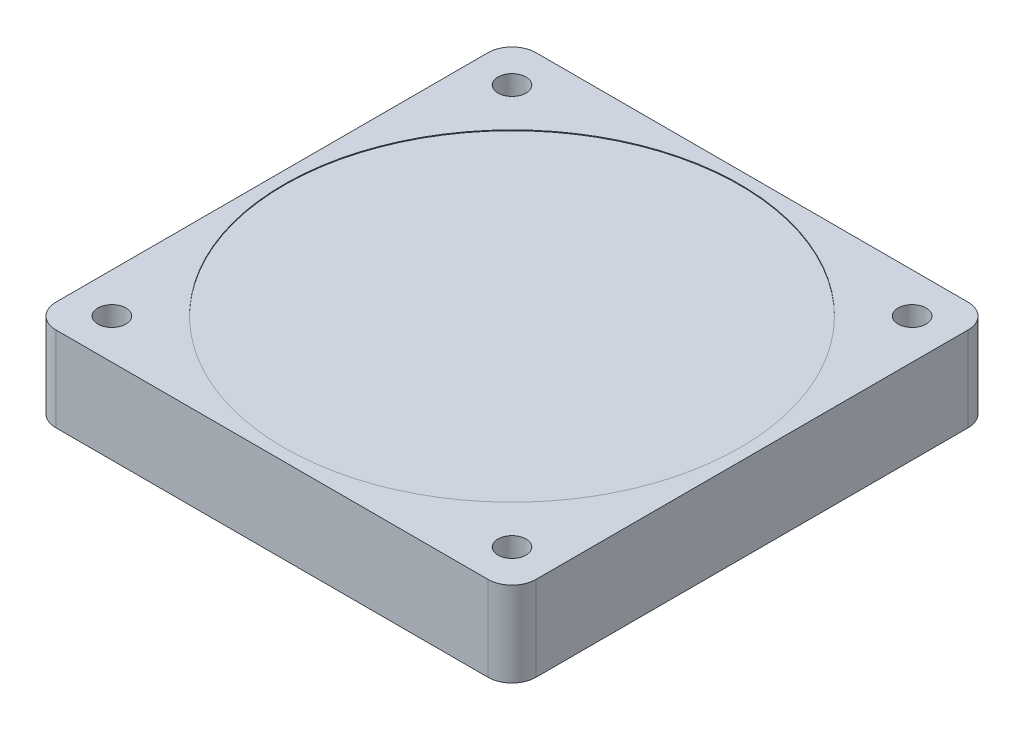
ISO-10303-21;
HEADER;
FILE_DESCRIPTION(('STEP AP214'),'2;1');
FILE_NAME('part.step','',(''),(''),'','','');
FILE_SCHEMA(('AUTOMOTIVE_DESIGN { 1 0 10303 214 1 1 1 1 }'));
ENDSEC;
DATA;
#1=APPLICATION_CONTEXT('core data for automotive mechanical design processes');
#2=APPLICATION_PROTOCOL_DEFINITION('international standard','automotive_design',2000,#1);
#3=PRODUCT_CONTEXT('',#1,'mechanical');
#4=PRODUCT('Part','Part','',(#3));
#5=PRODUCT_RELATED_PRODUCT_CATEGORY('part','',(#4));
#6=PRODUCT_DEFINITION_FORMATION('','',#4);
#7=PRODUCT_DEFINITION_CONTEXT('part definition',#1,'design');
#8=PRODUCT_DEFINITION('design','',#6,#7);
#9=PRODUCT_DEFINITION_SHAPE('','',#8);
#10=(LENGTH_UNIT() NAMED_UNIT(*) SI_UNIT(.MILLI.,.METRE.));
#11=(NAMED_UNIT(*) PLANE_ANGLE_UNIT() SI_UNIT($,.RADIAN.));
#12=(NAMED_UNIT(*) SI_UNIT($,.STERADIAN.) SOLID_ANGLE_UNIT());
#13=UNCERTAINTY_MEASURE_WITH_UNIT(LENGTH_MEASURE(1.E-05),#10,'distance_accuracy_value','');
#14=(GEOMETRIC_REPRESENTATION_CONTEXT(3) GLOBAL_UNCERTAINTY_ASSIGNED_CONTEXT((#13)) GLOBAL_UNIT_ASSIGNED_CONTEXT((#10,
#11,#12)) REPRESENTATION_CONTEXT('',''));
#15=CARTESIAN_POINT('',(0.,0.,0.));
#16=DIRECTION('',(0.,0.,1.));
#17=DIRECTION('',(1.,0.,0.));
#18=AXIS2_PLACEMENT_3D('',#15,#16,#17);
#19=CARTESIAN_POINT('',(-23.8888888888889,10.6,-31.5740740740741));
#20=DIRECTION('',(1.,0.,0.));
#21=DIRECTION('',(0.,0.,-1.));
#22=AXIS2_PLACEMENT_3D('',#19,#20,#21);
#23=PLANE('',#22);
#24=DIRECTION('',(0.,0.,1.));
#25=VECTOR('',#24,1.);
#26=CARTESIAN_POINT('',(-23.8888888888889,10.6,-31.5740740740741));
#27=LINE('',#26,#25);
#28=CARTESIAN_POINT('',(-23.8888888888889,10.6,-28.5740740740741));
#29=VERTEX_POINT('',#28);
#30=CARTESIAN_POINT('',(-23.8888888888889,10.6,25.4259259259259));
#31=VERTEX_POINT('',#30);
#32=EDGE_CURVE('E145',#29,#31,#27,.T.);
#33=ORIENTED_EDGE('',*,*,#32,.F.);
#34=DIRECTION('',(0.,-1.,0.));
#35=VECTOR('',#34,1.);
#36=CARTESIAN_POINT('',(-23.8888888888889,10.6,-28.5740740740741));
#37=LINE('',#36,#35);
#38=CARTESIAN_POINT('',(-23.8888888888889,0.,-28.5740740740741));
#39=VERTEX_POINT('',#38);
#40=EDGE_CURVE('E11',#29,#39,#37,.T.);
#41=ORIENTED_EDGE('',*,*,#40,.T.);
#42=DIRECTION('',(0.,0.,1.));
#43=VECTOR('',#42,1.);
#44=CARTESIAN_POINT('',(-23.8888888888889,0.,-31.5740740740741));
#45=LINE('',#44,#43);
#46=CARTESIAN_POINT('',(-23.8888888888889,0.,25.4259259259259));
#47=VERTEX_POINT('',#46);
#48=EDGE_CURVE('E147',#39,#47,#45,.T.);
#49=ORIENTED_EDGE('',*,*,#48,.T.);
#50=DIRECTION('',(0.,-1.,0.));
#51=VECTOR('',#50,1.);
#52=CARTESIAN_POINT('',(-23.8888888888889,10.6,25.4259259259259));
#53=LINE('',#52,#51);
#54=EDGE_CURVE('E53',#47,#31,#53,.F.);
#55=ORIENTED_EDGE('',*,*,#54,.T.);
#56=EDGE_LOOP('',(#33,#41,#49,#55));
#57=FACE_BOUND('',#56,.T.);
#58=ADVANCED_FACE('F44',(#57),#23,.F.);
#59=CARTESIAN_POINT('',(-23.8888888888889,10.6,28.4259259259259));
#60=DIRECTION('',(0.,0.,-1.));
#61=DIRECTION('',(-1.,0.,0.));
#62=AXIS2_PLACEMENT_3D('',#59,#60,#61);
#63=PLANE('',#62);
#64=DIRECTION('',(1.,0.,0.));
#65=VECTOR('',#64,1.);
#66=CARTESIAN_POINT('',(-23.8888888888889,0.,28.4259259259259));
#67=LINE('',#66,#65);
#68=CARTESIAN_POINT('',(-20.8888888888889,0.,28.4259259259259));
#69=VERTEX_POINT('',#68);
#70=CARTESIAN_POINT('',(33.1111111111111,0.,28.4259259259259));
#71=VERTEX_POINT('',#70);
#72=EDGE_CURVE('E141',#69,#71,#67,.T.);
#73=ORIENTED_EDGE('',*,*,#72,.T.);
#74=DIRECTION('',(0.,-1.,0.));
#75=VECTOR('',#74,1.);
#76=CARTESIAN_POINT('',(33.1111111111111,10.6,28.4259259259259));
#77=LINE('',#76,#75);
#78=CARTESIAN_POINT('',(33.1111111111111,10.6,28.4259259259259));
#79=VERTEX_POINT('',#78);
#80=EDGE_CURVE('E117',#71,#79,#77,.F.);
#81=ORIENTED_EDGE('',*,*,#80,.T.);
#82=DIRECTION('',(1.,0.,0.));
#83=VECTOR('',#82,1.);
#84=CARTESIAN_POINT('',(-23.8888888888889,10.6,28.4259259259259));
#85=LINE('',#84,#83);
#86=CARTESIAN_POINT('',(-20.8888888888889,10.6,28.4259259259259));
#87=VERTEX_POINT('',#86);
#88=EDGE_CURVE('E197',#87,#79,#85,.T.);
#89=ORIENTED_EDGE('',*,*,#88,.F.);
#90=DIRECTION('',(0.,-1.,0.));
#91=VECTOR('',#90,1.);
#92=CARTESIAN_POINT('',(-20.8888888888889,10.6,28.4259259259259));
#93=LINE('',#92,#91);
#94=EDGE_CURVE('E123',#87,#69,#93,.T.);
#95=ORIENTED_EDGE('',*,*,#94,.T.);
#96=EDGE_LOOP('',(#73,#81,#89,#95));
#97=FACE_BOUND('',#96,.T.);
#98=ADVANCED_FACE('F201',(#97),#63,.F.);
#99=CARTESIAN_POINT('',(36.1111111111111,10.6,-31.5740740740741));
#100=DIRECTION('',(-1.,0.,0.));
#101=DIRECTION('',(0.,0.,1.));
#102=AXIS2_PLACEMENT_3D('',#99,#100,#101);
#103=PLANE('',#102);
#104=DIRECTION('',(0.,0.,-1.));
#105=VECTOR('',#104,1.);
#106=CARTESIAN_POINT('',(36.1111111111111,10.6,-31.5740740740741));
#107=LINE('',#106,#105);
#108=CARTESIAN_POINT('',(36.1111111111111,10.6,25.4259259259259));
#109=VERTEX_POINT('',#108);
#110=CARTESIAN_POINT('',(36.1111111111111,10.6,-28.5740740740741));
#111=VERTEX_POINT('',#110);
#112=EDGE_CURVE('E132',#109,#111,#107,.T.);
#113=ORIENTED_EDGE('',*,*,#112,.F.);
#114=DIRECTION('',(0.,-1.,0.));
#115=VECTOR('',#114,1.);
#116=CARTESIAN_POINT('',(36.1111111111111,10.6,25.4259259259259));
#117=LINE('',#116,#115);
#118=CARTESIAN_POINT('',(36.1111111111111,0.,25.4259259259259));
#119=VERTEX_POINT('',#118);
#120=EDGE_CURVE('E116',#109,#119,#117,.T.);
#121=ORIENTED_EDGE('',*,*,#120,.T.);
#122=DIRECTION('',(0.,0.,-1.));
#123=VECTOR('',#122,1.);
#124=CARTESIAN_POINT('',(36.1111111111111,0.,-31.5740740740741));
#125=LINE('',#124,#123);
#126=CARTESIAN_POINT('',(36.1111111111111,0.,-28.5740740740741));
#127=VERTEX_POINT('',#126);
#128=EDGE_CURVE('E130',#119,#127,#125,.T.);
#129=ORIENTED_EDGE('',*,*,#128,.T.);
#130=DIRECTION('',(0.,-1.,0.));
#131=VECTOR('',#130,1.);
#132=CARTESIAN_POINT('',(36.1111111111111,10.6,-28.5740740740741));
#133=LINE('',#132,#131);
#134=EDGE_CURVE('E135',#127,#111,#133,.F.);
#135=ORIENTED_EDGE('',*,*,#134,.T.);
#136=EDGE_LOOP('',(#113,#121,#129,#135));
#137=FACE_BOUND('',#136,.T.);
#138=ADVANCED_FACE('F129',(#137),#103,.F.);
#139=CARTESIAN_POINT('',(-23.8888888888889,10.6,-31.5740740740741));
#140=DIRECTION('',(0.,0.,1.));
#141=DIRECTION('',(1.,0.,0.));
#142=AXIS2_PLACEMENT_3D('',#139,#140,#141);
#143=PLANE('',#142);
#144=DIRECTION('',(-1.,0.,0.));
#145=VECTOR('',#144,1.);
#146=CARTESIAN_POINT('',(-23.8888888888889,10.6,-31.5740740740741));
#147=LINE('',#146,#145);
#148=CARTESIAN_POINT('',(33.1111111111111,10.6,-31.5740740740741));
#149=VERTEX_POINT('',#148);
#150=CARTESIAN_POINT('',(-20.8888888888889,10.6,-31.5740740740741));
#151=VERTEX_POINT('',#150);
#152=EDGE_CURVE('E152',#149,#151,#147,.T.);
#153=ORIENTED_EDGE('',*,*,#152,.F.);
#154=DIRECTION('',(0.,-1.,0.));
#155=VECTOR('',#154,1.);
#156=CARTESIAN_POINT('',(33.1111111111111,10.6,-31.5740740740741));
#157=LINE('',#156,#155);
#158=CARTESIAN_POINT('',(33.1111111111111,0.,-31.5740740740741));
#159=VERTEX_POINT('',#158);
#160=EDGE_CURVE('E179',#149,#159,#157,.T.);
#161=ORIENTED_EDGE('',*,*,#160,.T.);
#162=DIRECTION('',(-1.,0.,0.));
#163=VECTOR('',#162,1.);
#164=CARTESIAN_POINT('',(-23.8888888888889,0.,-31.5740740740741));
#165=LINE('',#164,#163);
#166=CARTESIAN_POINT('',(-20.8888888888889,0.,-31.5740740740741));
#167=VERTEX_POINT('',#166);
#168=EDGE_CURVE('E140',#159,#167,#165,.T.);
#169=ORIENTED_EDGE('',*,*,#168,.T.);
#170=DIRECTION('',(0.,-1.,0.));
#171=VECTOR('',#170,1.);
#172=CARTESIAN_POINT('',(-20.8888888888889,10.6,-31.5740740740741));
#173=LINE('',#172,#171);
#174=EDGE_CURVE('E60',#167,#151,#173,.F.);
#175=ORIENTED_EDGE('',*,*,#174,.T.);
#176=EDGE_LOOP('',(#153,#161,#169,#175));
#177=FACE_BOUND('',#176,.T.);
#178=ADVANCED_FACE('F310',(#177),#143,.F.);
#179=CARTESIAN_POINT('',(0.,10.6,0.));
#180=DIRECTION('',(0.,1.,0.));
#181=DIRECTION('',(0.,0.,1.));
#182=AXIS2_PLACEMENT_3D('',#179,#180,#181);
#183=PLANE('',#182);
#184=CARTESIAN_POINT('',(6.11111111111111,10.6,-1.57407407407408));
#185=DIRECTION('',(0.,1.,0.));
#186=DIRECTION('',(0.,0.,1.));
#187=AXIS2_PLACEMENT_3D('',#184,#185,#186);
#188=CIRCLE('',#187,28.5);
#189=CARTESIAN_POINT('',(6.11111111111111,10.6,26.9259259259259));
#190=VERTEX_POINT('',#189);
#191=EDGE_CURVE('E243',#190,#190,#188,.T.);
#192=ORIENTED_EDGE('',*,*,#191,.F.);
#193=EDGE_LOOP('',(#192));
#194=FACE_BOUND('',#193,.T.);
#195=CARTESIAN_POINT('',(-18.8888888888889,10.6,23.4259259259259));
#196=DIRECTION('',(0.,1.,0.));
#197=DIRECTION('',(0.,0.,1.));
#198=AXIS2_PLACEMENT_3D('',#195,#196,#197);
#199=CIRCLE('',#198,1.75);
#200=CARTESIAN_POINT('',(-18.8888888888889,10.6,25.1759259259259));
#201=VERTEX_POINT('',#200);
#202=EDGE_CURVE('E223',#201,#201,#199,.T.);
#203=ORIENTED_EDGE('',*,*,#202,.F.);
#204=EDGE_LOOP('',(#203));
#205=FACE_BOUND('',#204,.T.);
#206=CARTESIAN_POINT('',(31.1111111111111,10.6,23.4259259259259));
#207=DIRECTION('',(0.,1.,0.));
#208=DIRECTION('',(0.,0.,1.));
#209=AXIS2_PLACEMENT_3D('',#206,#207,#208);
#210=CIRCLE('',#209,1.75);
#211=CARTESIAN_POINT('',(31.1111111111111,10.6,25.1759259259259));
#212=VERTEX_POINT('',#211);
#213=EDGE_CURVE('E232',#212,#212,#210,.T.);
#214=ORIENTED_EDGE('',*,*,#213,.F.);
#215=EDGE_LOOP('',(#214));
#216=FACE_BOUND('',#215,.T.);
#217=CARTESIAN_POINT('',(31.1111111111111,10.6,-26.5740740740741));
#218=DIRECTION('',(0.,1.,0.));
#219=DIRECTION('',(0.,0.,1.));
#220=AXIS2_PLACEMENT_3D('',#217,#218,#219);
#221=CIRCLE('',#220,1.75);
#222=CARTESIAN_POINT('',(31.1111111111111,10.6,-24.8240740740741));
#223=VERTEX_POINT('',#222);
#224=EDGE_CURVE('E217',#223,#223,#221,.T.);
#225=ORIENTED_EDGE('',*,*,#224,.F.);
#226=EDGE_LOOP('',(#225));
#227=FACE_BOUND('',#226,.T.);
#228=CARTESIAN_POINT('',(-18.8888888888889,10.6,-26.5740740740741));
#229=DIRECTION('',(0.,1.,0.));
#230=DIRECTION('',(0.,0.,1.));
#231=AXIS2_PLACEMENT_3D('',#228,#229,#230);
#232=CIRCLE('',#231,1.75);
#233=CARTESIAN_POINT('',(-18.8888888888889,10.6,-24.8240740740741));
#234=VERTEX_POINT('',#233);
#235=EDGE_CURVE('E206',#234,#234,#232,.T.);
#236=ORIENTED_EDGE('',*,*,#235,.F.);
#237=EDGE_LOOP('',(#236));
#238=FACE_BOUND('',#237,.T.);
#239=ORIENTED_EDGE('',*,*,#88,.T.);
#240=CARTESIAN_POINT('',(33.1111111111111,10.6,25.4259259259259));
#241=DIRECTION('',(0.,1.,0.));
#242=DIRECTION('',(0.,0.,1.));
#243=AXIS2_PLACEMENT_3D('',#240,#241,#242);
#244=CIRCLE('',#243,3.);
#245=EDGE_CURVE('E174',#79,#109,#244,.T.);
#246=ORIENTED_EDGE('',*,*,#245,.T.);
#247=ORIENTED_EDGE('',*,*,#112,.T.);
#248=CARTESIAN_POINT('',(33.1111111111111,10.6,-28.5740740740741));
#249=DIRECTION('',(0.,1.,0.));
#250=DIRECTION('',(0.,0.,1.));
#251=AXIS2_PLACEMENT_3D('',#248,#249,#250);
#252=CIRCLE('',#251,3.);
#253=EDGE_CURVE('E67',#111,#149,#252,.T.);
#254=ORIENTED_EDGE('',*,*,#253,.T.);
#255=ORIENTED_EDGE('',*,*,#152,.T.);
#256=CARTESIAN_POINT('',(-20.8888888888889,10.6,-28.5740740740741));
#257=DIRECTION('',(0.,1.,0.));
#258=DIRECTION('',(0.,0.,1.));
#259=AXIS2_PLACEMENT_3D('',#256,#257,#258);
#260=CIRCLE('',#259,3.);
#261=EDGE_CURVE('E169',#151,#29,#260,.T.);
#262=ORIENTED_EDGE('',*,*,#261,.T.);
#263=ORIENTED_EDGE('',*,*,#32,.T.);
#264=CARTESIAN_POINT('',(-20.8888888888889,10.6,25.4259259259259));
#265=DIRECTION('',(0.,1.,0.));
#266=DIRECTION('',(0.,0.,1.));
#267=AXIS2_PLACEMENT_3D('',#264,#265,#266);
#268=CIRCLE('',#267,3.);
#269=EDGE_CURVE('E166',#31,#87,#268,.T.);
#270=ORIENTED_EDGE('',*,*,#269,.T.);
#271=EDGE_LOOP('',(#239,#246,#247,#254,#255,#262,#263,#270));
#272=FACE_BOUND('',#271,.T.);
#273=ADVANCED_FACE('F193',(#194,#205,#216,#227,#238,#272),#183,.T.);
#274=CARTESIAN_POINT('',(0.,0.,0.));
#275=DIRECTION('',(0.,1.,0.));
#276=DIRECTION('',(0.,0.,1.));
#277=AXIS2_PLACEMENT_3D('',#274,#275,#276);
#278=PLANE('',#277);
#279=CARTESIAN_POINT('',(6.11111111111111,0.,-1.57407407407408));
#280=DIRECTION('',(0.,1.,0.));
#281=DIRECTION('',(0.,0.,1.));
#282=AXIS2_PLACEMENT_3D('',#279,#280,#281);
#283=CIRCLE('',#282,28.5);
#284=CARTESIAN_POINT('',(6.11111111111111,0.,26.9259259259259));
#285=VERTEX_POINT('',#284);
#286=EDGE_CURVE('E251',#285,#285,#283,.T.);
#287=ORIENTED_EDGE('',*,*,#286,.T.);
#288=EDGE_LOOP('',(#287));
#289=FACE_BOUND('',#288,.T.);
#290=CARTESIAN_POINT('',(-18.8888888888889,0.,23.4259259259259));
#291=DIRECTION('',(0.,1.,0.));
#292=DIRECTION('',(0.,0.,1.));
#293=AXIS2_PLACEMENT_3D('',#290,#291,#292);
#294=CIRCLE('',#293,1.75);
#295=CARTESIAN_POINT('',(-18.8888888888889,0.,25.1759259259259));
#296=VERTEX_POINT('',#295);
#297=EDGE_CURVE('E219',#296,#296,#294,.T.);
#298=ORIENTED_EDGE('',*,*,#297,.T.);
#299=EDGE_LOOP('',(#298));
#300=FACE_BOUND('',#299,.T.);
#301=CARTESIAN_POINT('',(31.1111111111111,0.,23.4259259259259));
#302=DIRECTION('',(0.,1.,0.));
#303=DIRECTION('',(0.,0.,1.));
#304=AXIS2_PLACEMENT_3D('',#301,#302,#303);
#305=CIRCLE('',#304,1.75);
#306=CARTESIAN_POINT('',(31.1111111111111,0.,25.1759259259259));
#307=VERTEX_POINT('',#306);
#308=EDGE_CURVE('E228',#307,#307,#305,.T.);
#309=ORIENTED_EDGE('',*,*,#308,.T.);
#310=EDGE_LOOP('',(#309));
#311=FACE_BOUND('',#310,.T.);
#312=CARTESIAN_POINT('',(31.1111111111111,0.,-26.5740740740741));
#313=DIRECTION('',(0.,1.,0.));
#314=DIRECTION('',(0.,0.,1.));
#315=AXIS2_PLACEMENT_3D('',#312,#313,#314);
#316=CIRCLE('',#315,1.75);
#317=CARTESIAN_POINT('',(31.1111111111111,0.,-24.8240740740741));
#318=VERTEX_POINT('',#317);
#319=EDGE_CURVE('E236',#318,#318,#316,.T.);
#320=ORIENTED_EDGE('',*,*,#319,.T.);
#321=EDGE_LOOP('',(#320));
#322=FACE_BOUND('',#321,.T.);
#323=CARTESIAN_POINT('',(-18.8888888888889,0.,-26.5740740740741));
#324=DIRECTION('',(0.,1.,0.));
#325=DIRECTION('',(0.,0.,1.));
#326=AXIS2_PLACEMENT_3D('',#323,#324,#325);
#327=CIRCLE('',#326,1.75);
#328=CARTESIAN_POINT('',(-18.8888888888889,0.,-24.8240740740741));
#329=VERTEX_POINT('',#328);
#330=EDGE_CURVE('E203',#329,#329,#327,.T.);
#331=ORIENTED_EDGE('',*,*,#330,.T.);
#332=EDGE_LOOP('',(#331));
#333=FACE_BOUND('',#332,.T.);
#334=ORIENTED_EDGE('',*,*,#128,.F.);
#335=CARTESIAN_POINT('',(33.1111111111111,0.,25.4259259259259));
#336=DIRECTION('',(0.,1.,0.));
#337=DIRECTION('',(0.,0.,1.));
#338=AXIS2_PLACEMENT_3D('',#335,#336,#337);
#339=CIRCLE('',#338,3.);
#340=EDGE_CURVE('E112',#119,#71,#339,.F.);
#341=ORIENTED_EDGE('',*,*,#340,.T.);
#342=ORIENTED_EDGE('',*,*,#72,.F.);
#343=CARTESIAN_POINT('',(-20.8888888888889,0.,25.4259259259259));
#344=DIRECTION('',(0.,1.,0.));
#345=DIRECTION('',(0.,0.,1.));
#346=AXIS2_PLACEMENT_3D('',#343,#344,#345);
#347=CIRCLE('',#346,3.);
#348=EDGE_CURVE('E134',#69,#47,#347,.F.);
#349=ORIENTED_EDGE('',*,*,#348,.T.);
#350=ORIENTED_EDGE('',*,*,#48,.F.);
#351=CARTESIAN_POINT('',(-20.8888888888889,0.,-28.5740740740741));
#352=DIRECTION('',(0.,1.,0.));
#353=DIRECTION('',(0.,0.,1.));
#354=AXIS2_PLACEMENT_3D('',#351,#352,#353);
#355=CIRCLE('',#354,3.);
#356=EDGE_CURVE('E156',#39,#167,#355,.F.);
#357=ORIENTED_EDGE('',*,*,#356,.T.);
#358=ORIENTED_EDGE('',*,*,#168,.F.);
#359=CARTESIAN_POINT('',(33.1111111111111,0.,-28.5740740740741));
#360=DIRECTION('',(0.,1.,0.));
#361=DIRECTION('',(0.,0.,1.));
#362=AXIS2_PLACEMENT_3D('',#359,#360,#361);
#363=CIRCLE('',#362,3.);
#364=EDGE_CURVE('E124',#159,#127,#363,.F.);
#365=ORIENTED_EDGE('',*,*,#364,.T.);
#366=EDGE_LOOP('',(#334,#341,#342,#349,#350,#357,#358,#365));
#367=FACE_BOUND('',#366,.T.);
#368=ADVANCED_FACE('F137',(#289,#300,#311,#322,#333,#367),#278,.F.);
#369=CARTESIAN_POINT('',(33.1111111111111,10.6,25.4259259259259));
#370=DIRECTION('',(0.,-1.,0.));
#371=DIRECTION('',(0.,0.,-1.));
#372=AXIS2_PLACEMENT_3D('',#369,#370,#371);
#373=CYLINDRICAL_SURFACE('',#372,3.);
#374=ORIENTED_EDGE('',*,*,#245,.F.);
#375=ORIENTED_EDGE('',*,*,#80,.F.);
#376=ORIENTED_EDGE('',*,*,#340,.F.);
#377=ORIENTED_EDGE('',*,*,#120,.F.);
#378=EDGE_LOOP('',(#374,#375,#376,#377));
#379=FACE_BOUND('',#378,.T.);
#380=ADVANCED_FACE('F115',(#379),#373,.T.);
#381=CARTESIAN_POINT('',(33.1111111111111,10.6,-28.5740740740741));
#382=DIRECTION('',(0.,-1.,0.));
#383=DIRECTION('',(0.,0.,-1.));
#384=AXIS2_PLACEMENT_3D('',#381,#382,#383);
#385=CYLINDRICAL_SURFACE('',#384,3.);
#386=ORIENTED_EDGE('',*,*,#253,.F.);
#387=ORIENTED_EDGE('',*,*,#134,.F.);
#388=ORIENTED_EDGE('',*,*,#364,.F.);
#389=ORIENTED_EDGE('',*,*,#160,.F.);
#390=EDGE_LOOP('',(#386,#387,#388,#389));
#391=FACE_BOUND('',#390,.T.);
#392=ADVANCED_FACE('F280',(#391),#385,.T.);
#393=CARTESIAN_POINT('',(-20.8888888888889,10.6,-28.5740740740741));
#394=DIRECTION('',(0.,-1.,0.));
#395=DIRECTION('',(0.,0.,-1.));
#396=AXIS2_PLACEMENT_3D('',#393,#394,#395);
#397=CYLINDRICAL_SURFACE('',#396,3.);
#398=ORIENTED_EDGE('',*,*,#261,.F.);
#399=ORIENTED_EDGE('',*,*,#174,.F.);
#400=ORIENTED_EDGE('',*,*,#356,.F.);
#401=ORIENTED_EDGE('',*,*,#40,.F.);
#402=EDGE_LOOP('',(#398,#399,#400,#401));
#403=FACE_BOUND('',#402,.T.);
#404=ADVANCED_FACE('F282',(#403),#397,.T.);
#405=CARTESIAN_POINT('',(-20.8888888888889,10.6,25.4259259259259));
#406=DIRECTION('',(0.,-1.,0.));
#407=DIRECTION('',(0.,0.,-1.));
#408=AXIS2_PLACEMENT_3D('',#405,#406,#407);
#409=CYLINDRICAL_SURFACE('',#408,3.);
#410=ORIENTED_EDGE('',*,*,#269,.F.);
#411=ORIENTED_EDGE('',*,*,#54,.F.);
#412=ORIENTED_EDGE('',*,*,#348,.F.);
#413=ORIENTED_EDGE('',*,*,#94,.F.);
#414=EDGE_LOOP('',(#410,#411,#412,#413));
#415=FACE_BOUND('',#414,.T.);
#416=ADVANCED_FACE('F46',(#415),#409,.T.);
#417=CARTESIAN_POINT('',(-18.8888888888889,0.,-26.5740740740741));
#418=DIRECTION('',(0.,1.,0.));
#419=DIRECTION('',(0.,0.,1.));
#420=AXIS2_PLACEMENT_3D('',#417,#418,#419);
#421=CYLINDRICAL_SURFACE('',#420,1.75);
#422=ORIENTED_EDGE('',*,*,#330,.F.);
#423=EDGE_LOOP('',(#422));
#424=FACE_BOUND('',#423,.T.);
#425=ORIENTED_EDGE('',*,*,#235,.T.);
#426=EDGE_LOOP('',(#425));
#427=FACE_BOUND('',#426,.T.);
#428=ADVANCED_FACE('F289',(#424,#427),#421,.F.);
#429=CARTESIAN_POINT('',(31.1111111111111,0.,-26.5740740740741));
#430=DIRECTION('',(0.,1.,0.));
#431=DIRECTION('',(0.,0.,1.));
#432=AXIS2_PLACEMENT_3D('',#429,#430,#431);
#433=CYLINDRICAL_SURFACE('',#432,1.75);
#434=ORIENTED_EDGE('',*,*,#319,.F.);
#435=EDGE_LOOP('',(#434));
#436=FACE_BOUND('',#435,.T.);
#437=ORIENTED_EDGE('',*,*,#224,.T.);
#438=EDGE_LOOP('',(#437));
#439=FACE_BOUND('',#438,.T.);
#440=ADVANCED_FACE('F293',(#436,#439),#433,.F.);
#441=CARTESIAN_POINT('',(31.1111111111111,0.,23.4259259259259));
#442=DIRECTION('',(0.,1.,0.));
#443=DIRECTION('',(0.,0.,1.));
#444=AXIS2_PLACEMENT_3D('',#441,#442,#443);
#445=CYLINDRICAL_SURFACE('',#444,1.75);
#446=ORIENTED_EDGE('',*,*,#308,.F.);
#447=EDGE_LOOP('',(#446));
#448=FACE_BOUND('',#447,.T.);
#449=ORIENTED_EDGE('',*,*,#213,.T.);
#450=EDGE_LOOP('',(#449));
#451=FACE_BOUND('',#450,.T.);
#452=ADVANCED_FACE('F299',(#448,#451),#445,.F.);
#453=CARTESIAN_POINT('',(-18.8888888888889,0.,23.4259259259259));
#454=DIRECTION('',(0.,1.,0.));
#455=DIRECTION('',(0.,0.,1.));
#456=AXIS2_PLACEMENT_3D('',#453,#454,#455);
#457=CYLINDRICAL_SURFACE('',#456,1.75);
#458=ORIENTED_EDGE('',*,*,#297,.F.);
#459=EDGE_LOOP('',(#458));
#460=FACE_BOUND('',#459,.T.);
#461=ORIENTED_EDGE('',*,*,#202,.T.);
#462=EDGE_LOOP('',(#461));
#463=FACE_BOUND('',#462,.T.);
#464=ADVANCED_FACE('F306',(#460,#463),#457,.F.);
#465=CARTESIAN_POINT('',(6.11111111111111,10.5,-1.57407407407408));
#466=DIRECTION('',(0.,1.,0.));
#467=DIRECTION('',(0.,0.,1.));
#468=AXIS2_PLACEMENT_3D('',#465,#466,#467);
#469=CYLINDRICAL_SURFACE('',#468,28.5);
#470=CARTESIAN_POINT('',(6.11111111111111,10.5,-1.57407407407408));
#471=DIRECTION('',(0.,1.,0.));
#472=DIRECTION('',(0.,0.,1.));
#473=AXIS2_PLACEMENT_3D('',#470,#471,#472);
#474=CIRCLE('',#473,28.5);
#475=CARTESIAN_POINT('',(6.11111111111111,10.5,26.9259259259259));
#476=VERTEX_POINT('',#475);
#477=EDGE_CURVE('E224',#476,#476,#474,.T.);
#478=ORIENTED_EDGE('',*,*,#477,.F.);
#479=EDGE_LOOP('',(#478));
#480=FACE_BOUND('',#479,.T.);
#481=ORIENTED_EDGE('',*,*,#191,.T.);
#482=EDGE_LOOP('',(#481));
#483=FACE_BOUND('',#482,.T.);
#484=ADVANCED_FACE('F390',(#480,#483),#469,.F.);
#485=CARTESIAN_POINT('',(0.,10.5,0.));
#486=DIRECTION('',(0.,1.,0.));
#487=DIRECTION('',(0.,0.,1.));
#488=AXIS2_PLACEMENT_3D('',#485,#486,#487);
#489=PLANE('',#488);
#490=ORIENTED_EDGE('',*,*,#477,.T.);
#491=EDGE_LOOP('',(#490));
#492=FACE_BOUND('',#491,.T.);
#493=ADVANCED_FACE('F268',(#492),#489,.T.);
#494=CARTESIAN_POINT('',(6.11111111111111,0.1,-1.57407407407408));
#495=DIRECTION('',(0.,-1.,0.));
#496=DIRECTION('',(0.,0.,-1.));
#497=AXIS2_PLACEMENT_3D('',#494,#495,#496);
#498=CYLINDRICAL_SURFACE('',#497,28.5);
#499=CARTESIAN_POINT('',(6.11111111111111,0.1,-1.57407407407408));
#500=DIRECTION('',(0.,1.,0.));
#501=DIRECTION('',(0.,0.,1.));
#502=AXIS2_PLACEMENT_3D('',#499,#500,#501);
#503=CIRCLE('',#502,28.5);
#504=CARTESIAN_POINT('',(6.11111111111111,0.1,26.9259259259259));
#505=VERTEX_POINT('',#504);
#506=EDGE_CURVE('E247',#505,#505,#503,.T.);
#507=ORIENTED_EDGE('',*,*,#506,.T.);
#508=EDGE_LOOP('',(#507));
#509=FACE_BOUND('',#508,.T.);
#510=ORIENTED_EDGE('',*,*,#286,.F.);
#511=EDGE_LOOP('',(#510));
#512=FACE_BOUND('',#511,.T.);
#513=ADVANCED_FACE('F259',(#509,#512),#498,.F.);
#514=CARTESIAN_POINT('',(6.11111111111111,0.1,-1.57407407407408));
#515=DIRECTION('',(0.,1.,0.));
#516=DIRECTION('',(0.,0.,1.));
#517=AXIS2_PLACEMENT_3D('',#514,#515,#516);
#518=PLANE('',#517);
#519=ORIENTED_EDGE('',*,*,#506,.F.);
#520=EDGE_LOOP('',(#519));
#521=FACE_BOUND('',#520,.T.);
#522=ADVANCED_FACE('F262',(#521),#518,.F.);
#523=CLOSED_SHELL('',(#58,#98,#138,#178,#273,#368,#380,#392,#404,#416,#428,#440,#452,#464,#484,
#493,#513,#522));
#524=MANIFOLD_SOLID_BREP('B2',#523);
#525=ADVANCED_BREP_SHAPE_REPRESENTATION('',(#18,#524),#14);
#526=SHAPE_DEFINITION_REPRESENTATION(#9,#525);
ENDSEC;
END-ISO-10303-21;
